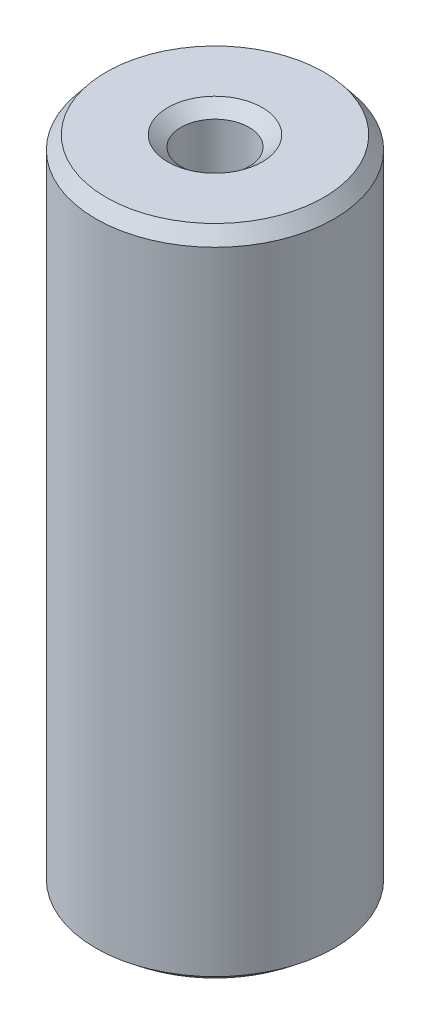
ISO-10303-21;
HEADER;
FILE_DESCRIPTION(('STEP AP214'),'2;1');
FILE_NAME('part.step','',(''),(''),'','','');
FILE_SCHEMA(('AUTOMOTIVE_DESIGN { 1 0 10303 214 1 1 1 1 }'));
ENDSEC;
DATA;
#1=APPLICATION_CONTEXT('core data for automotive mechanical design processes');
#2=APPLICATION_PROTOCOL_DEFINITION('international standard','automotive_design',2000,#1);
#3=PRODUCT_CONTEXT('',#1,'mechanical');
#4=PRODUCT('Part','Part','',(#3));
#5=PRODUCT_RELATED_PRODUCT_CATEGORY('part','',(#4));
#6=PRODUCT_DEFINITION_FORMATION('','',#4);
#7=PRODUCT_DEFINITION_CONTEXT('part definition',#1,'design');
#8=PRODUCT_DEFINITION('design','',#6,#7);
#9=PRODUCT_DEFINITION_SHAPE('','',#8);
#10=(LENGTH_UNIT() NAMED_UNIT(*) SI_UNIT(.MILLI.,.METRE.));
#11=(NAMED_UNIT(*) PLANE_ANGLE_UNIT() SI_UNIT($,.RADIAN.));
#12=(NAMED_UNIT(*) SI_UNIT($,.STERADIAN.) SOLID_ANGLE_UNIT());
#13=UNCERTAINTY_MEASURE_WITH_UNIT(LENGTH_MEASURE(1.E-05),#10,'distance_accuracy_value','');
#14=(GEOMETRIC_REPRESENTATION_CONTEXT(3) GLOBAL_UNCERTAINTY_ASSIGNED_CONTEXT((#13)) GLOBAL_UNIT_ASSIGNED_CONTEXT((#10,
#11,#12)) REPRESENTATION_CONTEXT('',''));
#15=CARTESIAN_POINT('',(0.,0.,0.));
#16=DIRECTION('',(0.,0.,1.));
#17=DIRECTION('',(1.,0.,0.));
#18=AXIS2_PLACEMENT_3D('',#15,#16,#17);
#19=CARTESIAN_POINT('',(0.,27.4719907984858,0.));
#20=DIRECTION('',(0.,-1.,0.));
#21=DIRECTION('',(0.,0.,-1.));
#22=AXIS2_PLACEMENT_3D('',#19,#20,#21);
#23=CYLINDRICAL_SURFACE('',#22,5.);
#24=CARTESIAN_POINT('',(0.,0.442886499713076,0.));
#25=DIRECTION('',(0.,1.,0.));
#26=DIRECTION('',(0.,0.,1.));
#27=AXIS2_PLACEMENT_3D('',#24,#25,#26);
#28=CIRCLE('',#27,5.);
#29=CARTESIAN_POINT('',(0.,0.442886499713073,-5.));
#30=VERTEX_POINT('',#29);
#31=EDGE_CURVE('E10',#30,#30,#28,.T.);
#32=CARTESIAN_POINT('',(0.,26.9202780463634,0.));
#33=DIRECTION('',(0.,1.,0.));
#34=DIRECTION('',(0.,0.,1.));
#35=AXIS2_PLACEMENT_3D('',#32,#33,#34);
#36=CIRCLE('',#35,5.);
#37=CARTESIAN_POINT('',(0.,26.9202780463634,-5.));
#38=VERTEX_POINT('',#37);
#39=EDGE_CURVE('E50',#38,#38,#36,.F.);
#40=CARTESIAN_POINT('',(0.,0.442886499713073,-5.));
#41=CARTESIAN_POINT('',(0.,0.718692661657348,-5.));
#42=CARTESIAN_POINT('',(0.,0.994498823601623,-5.));
#43=CARTESIAN_POINT('',(0.,1.54611114749017,-5.));
#44=CARTESIAN_POINT('',(0.,1.82191730943445,-5.));
#45=CARTESIAN_POINT('',(0.,2.373529633323,-5.));
#46=CARTESIAN_POINT('',(0.,2.64933579526727,-5.));
#47=CARTESIAN_POINT('',(0.,3.20094811915582,-5.));
#48=CARTESIAN_POINT('',(0.,3.47675428110009,-5.));
#49=CARTESIAN_POINT('',(0.,4.02836660498864,-5.));
#50=CARTESIAN_POINT('',(0.,4.30417276693292,-5.));
#51=CARTESIAN_POINT('',(0.,4.85578509082147,-5.));
#52=CARTESIAN_POINT('',(0.,5.13159125276574,-5.));
#53=CARTESIAN_POINT('',(0.,5.68320357665429,-5.));
#54=CARTESIAN_POINT('',(0.,5.95900973859857,-5.));
#55=CARTESIAN_POINT('',(0.,6.51062206248711,-5.));
#56=CARTESIAN_POINT('',(0.,6.78642822443139,-5.));
#57=CARTESIAN_POINT('',(0.,7.33804054831994,-5.));
#58=CARTESIAN_POINT('',(0.,7.61384671026422,-5.));
#59=CARTESIAN_POINT('',(0.,8.16545903415276,-5.));
#60=CARTESIAN_POINT('',(0.,8.44126519609704,-5.));
#61=CARTESIAN_POINT('',(0.,8.99287751998559,-5.));
#62=CARTESIAN_POINT('',(0.,9.26868368192986,-5.));
#63=CARTESIAN_POINT('',(0.,9.82029600581841,-5.));
#64=CARTESIAN_POINT('',(0.,10.0961021677627,-5.));
#65=CARTESIAN_POINT('',(0.,10.6477144916512,-5.));
#66=CARTESIAN_POINT('',(0.,10.9235206535955,-5.));
#67=CARTESIAN_POINT('',(0.,11.4751329774841,-5.));
#68=CARTESIAN_POINT('',(0.,11.7509391394283,-5.));
#69=CARTESIAN_POINT('',(0.,12.3025514633169,-5.));
#70=CARTESIAN_POINT('',(0.,12.5783576252612,-5.));
#71=CARTESIAN_POINT('',(0.,13.1299699491497,-5.));
#72=CARTESIAN_POINT('',(0.,13.405776111094,-5.));
#73=CARTESIAN_POINT('',(0.,13.9573884349825,-5.));
#74=CARTESIAN_POINT('',(0.,14.2331945969268,-5.));
#75=CARTESIAN_POINT('',(0.,14.7848069208154,-5.));
#76=CARTESIAN_POINT('',(0.,15.0606130827596,-5.));
#77=CARTESIAN_POINT('',(0.,15.6122254066482,-5.));
#78=CARTESIAN_POINT('',(0.,15.8880315685925,-5.));
#79=CARTESIAN_POINT('',(0.,16.439643892481,-5.));
#80=CARTESIAN_POINT('',(0.,16.7154500544253,-5.));
#81=CARTESIAN_POINT('',(0.,17.2670623783138,-5.));
#82=CARTESIAN_POINT('',(0.,17.5428685402581,-5.));
#83=CARTESIAN_POINT('',(0.,18.0944808641467,-5.));
#84=CARTESIAN_POINT('',(0.,18.3702870260909,-5.));
#85=CARTESIAN_POINT('',(0.,18.9218993499795,-5.));
#86=CARTESIAN_POINT('',(0.,19.1977055119238,-5.));
#87=CARTESIAN_POINT('',(0.,19.7493178358123,-5.));
#88=CARTESIAN_POINT('',(0.,20.0251239977566,-5.));
#89=CARTESIAN_POINT('',(0.,20.5767363216451,-5.));
#90=CARTESIAN_POINT('',(0.,20.8525424835894,-5.));
#91=CARTESIAN_POINT('',(0.,21.4041548074779,-5.));
#92=CARTESIAN_POINT('',(0.,21.6799609694222,-5.));
#93=CARTESIAN_POINT('',(0.,22.2315732933108,-5.));
#94=CARTESIAN_POINT('',(0.,22.507379455255,-5.));
#95=CARTESIAN_POINT('',(0.,23.0589917791436,-5.));
#96=CARTESIAN_POINT('',(0.,23.3347979410879,-5.));
#97=CARTESIAN_POINT('',(0.,23.8864102649764,-5.));
#98=CARTESIAN_POINT('',(0.,24.1622164269207,-5.));
#99=CARTESIAN_POINT('',(0.,24.7138287508092,-5.));
#100=CARTESIAN_POINT('',(0.,24.9896349127535,-5.));
#101=CARTESIAN_POINT('',(0.,25.5412472366421,-5.));
#102=CARTESIAN_POINT('',(0.,25.8170533985863,-5.));
#103=CARTESIAN_POINT('',(0.,26.3686657224749,-5.));
#104=CARTESIAN_POINT('',(0.,26.6444718844192,-5.));
#105=CARTESIAN_POINT('',(0.,26.9202780463634,-5.));
#106=B_SPLINE_CURVE_WITH_KNOTS('',3,(#40,#41,#42,#43,#44,#45,#46,#47,#48,#49,#50,#51,#52,#53,
#54,#55,#56,#57,#58,#59,#60,#61,#62,#63,#64,#65,#66,#67,#68,#69,#70,#71,#72,#73,#74,#75,#76,#77,
#78,#79,#80,#81,#82,#83,#84,#85,#86,#87,#88,#89,#90,#91,#92,#93,#94,#95,#96,#97,#98,#99,#100,
#101,#102,#103,#104,#105),.UNSPECIFIED.,.F.,.F.,(4,2,2,2,2,2,2,2,2,2,2,2,2,2,2,2,2,2,2,2,2,2,2,
2,2,2,2,2,2,2,2,2,4),(0.,0.827418485832825,1.65483697166565,2.48225545749847,3.30967394333129,
4.13709242916412,4.96451091499694,5.79192940082977,6.61934788666259,7.44676637249542,
8.27418485832824,9.10160334416106,9.92902182999389,10.7564403158267,11.5838588016595,
12.4112772874924,13.2386957733252,14.066114259158,14.8935327449908,15.7209512308237,
16.5483697166565,17.3757882024893,18.2032066883221,19.0306251741549,19.8580436599878,
20.6854621458206,21.5128806316534,22.3402991174862,23.1677176033191,23.9951360891519,
24.8225545749847,25.6499730608175,26.4773915466504),.UNSPECIFIED.);
#107=EDGE_CURVE('BSEAM39',#30,#38,#106,.T.);
#108=ORIENTED_EDGE('',*,*,#31,.T.);
#109=ORIENTED_EDGE('',*,*,#39,.T.);
#110=ORIENTED_EDGE('',*,*,#107,.T.);
#111=ORIENTED_EDGE('',*,*,#107,.F.);
#112=EDGE_LOOP('',(#108,#110,#109,#111));
#113=FACE_BOUND('',#112,.T.);
#114=ADVANCED_FACE('F39',(#113),#23,.T.);
#115=CARTESIAN_POINT('',(0.,27.4719907984858,0.));
#116=DIRECTION('',(0.,1.,0.));
#117=DIRECTION('',(0.,0.,1.));
#118=AXIS2_PLACEMENT_3D('',#115,#116,#117);
#119=PLANE('',#118);
#120=CARTESIAN_POINT('',(0.,27.4719907984858,0.));
#121=DIRECTION('',(0.,1.,0.));
#122=DIRECTION('',(0.,0.,1.));
#123=AXIS2_PLACEMENT_3D('',#120,#121,#122);
#124=CIRCLE('',#123,1.97827782516624);
#125=CARTESIAN_POINT('',(0.,27.4719907984858,1.97827782516624));
#126=VERTEX_POINT('',#125);
#127=EDGE_CURVE('E58',#126,#126,#124,.F.);
#128=ORIENTED_EDGE('',*,*,#127,.T.);
#129=EDGE_LOOP('',(#128));
#130=FACE_BOUND('',#129,.T.);
#131=CARTESIAN_POINT('',(0.,27.4719907984858,0.));
#132=DIRECTION('',(0.,1.,0.));
#133=DIRECTION('',(0.,0.,1.));
#134=AXIS2_PLACEMENT_3D('',#131,#132,#133);
#135=CIRCLE('',#134,4.55711350028695);
#136=CARTESIAN_POINT('',(0.,27.4719907984858,4.55711350028695));
#137=VERTEX_POINT('',#136);
#138=EDGE_CURVE('E61',#137,#137,#135,.T.);
#139=ORIENTED_EDGE('',*,*,#138,.T.);
#140=EDGE_LOOP('',(#139));
#141=FACE_BOUND('',#140,.T.);
#142=ADVANCED_FACE('F88',(#130,#141),#119,.T.);
#143=CARTESIAN_POINT('',(0.,0.,0.));
#144=DIRECTION('',(0.,1.,0.));
#145=DIRECTION('',(0.,0.,1.));
#146=AXIS2_PLACEMENT_3D('',#143,#144,#145);
#147=PLANE('',#146);
#148=CARTESIAN_POINT('',(0.,0.,0.));
#149=DIRECTION('',(0.,1.,0.));
#150=DIRECTION('',(0.,0.,1.));
#151=AXIS2_PLACEMENT_3D('',#148,#149,#150);
#152=CIRCLE('',#151,1.86945157275692);
#153=CARTESIAN_POINT('',(0.,0.,1.86945157275692));
#154=VERTEX_POINT('',#153);
#155=EDGE_CURVE('E51',#154,#154,#152,.T.);
#156=ORIENTED_EDGE('',*,*,#155,.T.);
#157=EDGE_LOOP('',(#156));
#158=FACE_BOUND('',#157,.T.);
#159=CARTESIAN_POINT('',(0.,0.,0.));
#160=DIRECTION('',(0.,1.,0.));
#161=DIRECTION('',(0.,0.,1.));
#162=AXIS2_PLACEMENT_3D('',#159,#160,#161);
#163=CIRCLE('',#162,4.44828724787763);
#164=CARTESIAN_POINT('',(0.,0.,4.44828724787763));
#165=VERTEX_POINT('',#164);
#166=EDGE_CURVE('E54',#165,#165,#163,.F.);
#167=ORIENTED_EDGE('',*,*,#166,.T.);
#168=EDGE_LOOP('',(#167));
#169=FACE_BOUND('',#168,.T.);
#170=ADVANCED_FACE('F83',(#158,#169),#147,.F.);
#171=CARTESIAN_POINT('',(0.,27.4719907984858,0.));
#172=DIRECTION('',(0.,-1.,0.));
#173=DIRECTION('',(0.,0.,-1.));
#174=AXIS2_PLACEMENT_3D('',#171,#172,#173);
#175=CYLINDRICAL_SURFACE('',#174,1.42656507304387);
#176=CARTESIAN_POINT('',(0.,27.0291042987727,0.));
#177=DIRECTION('',(0.,1.,0.));
#178=DIRECTION('',(0.,0.,1.));
#179=AXIS2_PLACEMENT_3D('',#176,#177,#178);
#180=CIRCLE('',#179,1.42656507304387);
#181=CARTESIAN_POINT('',(0.,27.0291042987727,-1.42656507304387));
#182=VERTEX_POINT('',#181);
#183=EDGE_CURVE('E67',#182,#182,#180,.T.);
#184=CARTESIAN_POINT('',(0.,0.55171275212235,0.));
#185=DIRECTION('',(0.,1.,0.));
#186=DIRECTION('',(0.,0.,1.));
#187=AXIS2_PLACEMENT_3D('',#184,#185,#186);
#188=CIRCLE('',#187,1.42656507304387);
#189=CARTESIAN_POINT('',(0.,0.551712752122346,-1.42656507304387));
#190=VERTEX_POINT('',#189);
#191=EDGE_CURVE('E69',#190,#190,#188,.F.);
#192=CARTESIAN_POINT('',(0.,27.0291042987727,-1.42656507304387));
#193=CARTESIAN_POINT('',(0.,26.7532981368284,-1.42656507304387));
#194=CARTESIAN_POINT('',(0.,26.4774919748841,-1.42656507304387));
#195=CARTESIAN_POINT('',(0.,25.9258796509956,-1.42656507304387));
#196=CARTESIAN_POINT('',(0.,25.6500734890513,-1.42656507304387));
#197=CARTESIAN_POINT('',(0.,25.0984611651628,-1.42656507304387));
#198=CARTESIAN_POINT('',(0.,24.8226550032185,-1.42656507304387));
#199=CARTESIAN_POINT('',(0.,24.2710426793299,-1.42656507304387));
#200=CARTESIAN_POINT('',(0.,23.9952365173857,-1.42656507304387));
#201=CARTESIAN_POINT('',(0.,23.4436241934971,-1.42656507304387));
#202=CARTESIAN_POINT('',(0.,23.1678180315529,-1.42656507304387));
#203=CARTESIAN_POINT('',(0.,22.6162057076643,-1.42656507304387));
#204=CARTESIAN_POINT('',(0.,22.34039954572,-1.42656507304387));
#205=CARTESIAN_POINT('',(0.,21.7887872218315,-1.42656507304387));
#206=CARTESIAN_POINT('',(0.,21.5129810598872,-1.42656507304387));
#207=CARTESIAN_POINT('',(0.,20.9613687359987,-1.42656507304387));
#208=CARTESIAN_POINT('',(0.,20.6855625740544,-1.42656507304387));
#209=CARTESIAN_POINT('',(0.,20.1339502501658,-1.42656507304387));
#210=CARTESIAN_POINT('',(0.,19.8581440882216,-1.42656507304387));
#211=CARTESIAN_POINT('',(0.,19.306531764333,-1.42656507304387));
#212=CARTESIAN_POINT('',(0.,19.0307256023887,-1.42656507304387));
#213=CARTESIAN_POINT('',(0.,18.4791132785002,-1.42656507304387));
#214=CARTESIAN_POINT('',(0.,18.2033071165559,-1.42656507304387));
#215=CARTESIAN_POINT('',(0.,17.6516947926674,-1.42656507304387));
#216=CARTESIAN_POINT('',(0.,17.3758886307231,-1.42656507304387));
#217=CARTESIAN_POINT('',(0.,16.8242763068345,-1.42656507304387));
#218=CARTESIAN_POINT('',(0.,16.5484701448903,-1.42656507304387));
#219=CARTESIAN_POINT('',(0.,15.9968578210017,-1.42656507304387));
#220=CARTESIAN_POINT('',(0.,15.7210516590574,-1.42656507304387));
#221=CARTESIAN_POINT('',(0.,15.1694393351689,-1.42656507304387));
#222=CARTESIAN_POINT('',(0.,14.8936331732246,-1.42656507304387));
#223=CARTESIAN_POINT('',(0.,14.3420208493361,-1.42656507304387));
#224=CARTESIAN_POINT('',(0.,14.0662146873918,-1.42656507304387));
#225=CARTESIAN_POINT('',(0.,13.5146023635032,-1.42656507304387));
#226=CARTESIAN_POINT('',(0.,13.238796201559,-1.42656507304387));
#227=CARTESIAN_POINT('',(0.,12.6871838776704,-1.42656507304387));
#228=CARTESIAN_POINT('',(0.,12.4113777157261,-1.42656507304387));
#229=CARTESIAN_POINT('',(0.,11.8597653918376,-1.42656507304387));
#230=CARTESIAN_POINT('',(0.,11.5839592298933,-1.42656507304387));
#231=CARTESIAN_POINT('',(0.,11.0323469060048,-1.42656507304387));
#232=CARTESIAN_POINT('',(0.,10.7565407440605,-1.42656507304387));
#233=CARTESIAN_POINT('',(0.,10.204928420172,-1.42656507304387));
#234=CARTESIAN_POINT('',(0.,9.92912225822768,-1.42656507304387));
#235=CARTESIAN_POINT('',(0.,9.37750993433913,-1.42656507304387));
#236=CARTESIAN_POINT('',(0.,9.10170377239485,-1.42656507304387));
#237=CARTESIAN_POINT('',(0.,8.5500914485063,-1.42656507304387));
#238=CARTESIAN_POINT('',(0.,8.27428528656203,-1.42656507304387));
#239=CARTESIAN_POINT('',(0.,7.72267296267348,-1.42656507304387));
#240=CARTESIAN_POINT('',(0.,7.44686680072921,-1.42656507304387));
#241=CARTESIAN_POINT('',(0.,6.89525447684066,-1.42656507304387));
#242=CARTESIAN_POINT('',(0.,6.61944831489638,-1.42656507304387));
#243=CARTESIAN_POINT('',(0.,6.06783599100784,-1.42656507304387));
#244=CARTESIAN_POINT('',(0.,5.79202982906356,-1.42656507304387));
#245=CARTESIAN_POINT('',(0.,5.24041750517501,-1.42656507304387));
#246=CARTESIAN_POINT('',(0.,4.96461134323074,-1.42656507304387));
#247=CARTESIAN_POINT('',(0.,4.41299901934219,-1.42656507304387));
#248=CARTESIAN_POINT('',(0.,4.13719285739791,-1.42656507304387));
#249=CARTESIAN_POINT('',(0.,3.58558053350937,-1.42656507304387));
#250=CARTESIAN_POINT('',(0.,3.30977437156509,-1.42656507304387));
#251=CARTESIAN_POINT('',(0.,2.75816204767654,-1.42656507304387));
#252=CARTESIAN_POINT('',(0.,2.48235588573227,-1.42656507304387));
#253=CARTESIAN_POINT('',(0.,1.93074356184372,-1.42656507304387));
#254=CARTESIAN_POINT('',(0.,1.65493739989944,-1.42656507304387));
#255=CARTESIAN_POINT('',(0.,1.10332507601089,-1.42656507304387));
#256=CARTESIAN_POINT('',(0.,0.82751891406662,-1.42656507304387));
#257=CARTESIAN_POINT('',(0.,0.551712752122346,-1.42656507304387));
#258=B_SPLINE_CURVE_WITH_KNOTS('',3,(#192,#193,#194,#195,#196,#197,#198,#199,#200,#201,#202,
#203,#204,#205,#206,#207,#208,#209,#210,#211,#212,#213,#214,#215,#216,#217,#218,#219,#220,#221,
#222,#223,#224,#225,#226,#227,#228,#229,#230,#231,#232,#233,#234,#235,#236,#237,#238,#239,#240,
#241,#242,#243,#244,#245,#246,#247,#248,#249,#250,#251,#252,#253,#254,#255,#256,#257),
.UNSPECIFIED.,.F.,.F.,(4,2,2,2,2,2,2,2,2,2,2,2,2,2,2,2,2,2,2,2,2,2,2,2,2,2,2,2,2,2,2,2,4),(0.,
0.827418485832822,1.65483697166564,2.48225545749847,3.30967394333129,4.13709242916411,
4.96451091499694,5.79192940082976,6.61934788666258,7.44676637249541,8.27418485832823,
9.10160334416105,9.92902182999388,10.7564403158267,11.5838588016595,12.4112772874923,
13.2386957733252,14.066114259158,14.8935327449908,15.7209512308236,16.5483697166565,
17.3757882024893,18.2032066883221,19.0306251741549,19.8580436599878,20.6854621458206,
21.5128806316534,22.3402991174862,23.167717603319,23.9951360891519,24.8225545749847,
25.6499730608175,26.4773915466503),.UNSPECIFIED.);
#259=EDGE_CURVE('BSEAM71',#182,#190,#258,.T.);
#260=ORIENTED_EDGE('',*,*,#183,.T.);
#261=ORIENTED_EDGE('',*,*,#191,.T.);
#262=ORIENTED_EDGE('',*,*,#259,.T.);
#263=ORIENTED_EDGE('',*,*,#259,.F.);
#264=EDGE_LOOP('',(#260,#262,#261,#263));
#265=FACE_BOUND('',#264,.T.);
#266=ADVANCED_FACE('F71',(#265),#175,.F.);
#267=CARTESIAN_POINT('',(0.,27.0291042987727,0.));
#268=DIRECTION('',(0.,1.,0.));
#269=DIRECTION('',(0.,0.,1.));
#270=AXIS2_PLACEMENT_3D('',#267,#268,#269);
#271=CONICAL_SURFACE('',#270,1.42656507304387,0.894381808565411);
#272=ORIENTED_EDGE('',*,*,#127,.F.);
#273=EDGE_LOOP('',(#272));
#274=FACE_BOUND('',#273,.T.);
#275=ORIENTED_EDGE('',*,*,#183,.F.);
#276=EDGE_LOOP('',(#275));
#277=FACE_BOUND('',#276,.T.);
#278=ADVANCED_FACE('F77',(#274,#277),#271,.F.);
#279=CARTESIAN_POINT('',(0.,0.,0.));
#280=DIRECTION('',(0.,-1.,0.));
#281=DIRECTION('',(0.,0.,-1.));
#282=AXIS2_PLACEMENT_3D('',#279,#280,#281);
#283=CONICAL_SURFACE('',#282,1.86945157275692,0.676414518229478);
#284=ORIENTED_EDGE('',*,*,#191,.F.);
#285=EDGE_LOOP('',(#284));
#286=FACE_BOUND('',#285,.T.);
#287=ORIENTED_EDGE('',*,*,#155,.F.);
#288=EDGE_LOOP('',(#287));
#289=FACE_BOUND('',#288,.T.);
#290=ADVANCED_FACE('F73',(#286,#289),#283,.F.);
#291=CARTESIAN_POINT('',(0.,0.442886499713076,0.));
#292=DIRECTION('',(0.,1.,0.));
#293=DIRECTION('',(0.,0.,1.));
#294=AXIS2_PLACEMENT_3D('',#291,#292,#293);
#295=CONICAL_SURFACE('',#294,5.,0.894381808565412);
#296=ORIENTED_EDGE('',*,*,#166,.F.);
#297=EDGE_LOOP('',(#296));
#298=FACE_BOUND('',#297,.T.);
#299=ORIENTED_EDGE('',*,*,#31,.F.);
#300=EDGE_LOOP('',(#299));
#301=FACE_BOUND('',#300,.T.);
#302=ADVANCED_FACE('F76',(#298,#301),#295,.T.);
#303=CARTESIAN_POINT('',(0.,27.4719907984858,0.));
#304=DIRECTION('',(0.,-1.,0.));
#305=DIRECTION('',(0.,0.,-1.));
#306=AXIS2_PLACEMENT_3D('',#303,#304,#305);
#307=CONICAL_SURFACE('',#306,4.55711350028695,0.676414518229485);
#308=ORIENTED_EDGE('',*,*,#39,.F.);
#309=EDGE_LOOP('',(#308));
#310=FACE_BOUND('',#309,.T.);
#311=ORIENTED_EDGE('',*,*,#138,.F.);
#312=EDGE_LOOP('',(#311));
#313=FACE_BOUND('',#312,.T.);
#314=ADVANCED_FACE('F45',(#310,#313),#307,.T.);
#315=CLOSED_SHELL('',(#114,#142,#170,#266,#278,#290,#302,#314));
#316=MANIFOLD_SOLID_BREP('B2',#315);
#317=ADVANCED_BREP_SHAPE_REPRESENTATION('',(#18,#316),#14);
#318=SHAPE_DEFINITION_REPRESENTATION(#9,#317);
ENDSEC;
END-ISO-10303-21;
